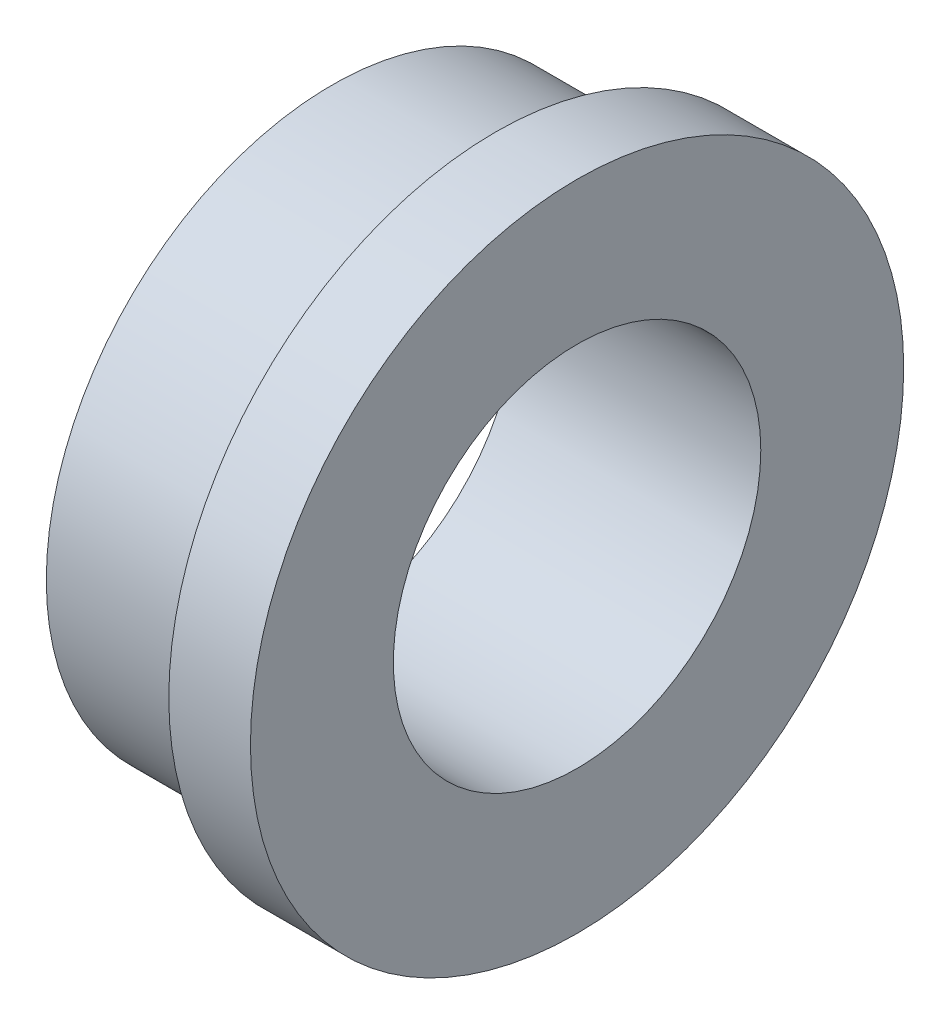
ISO-10303-21;
HEADER;
FILE_DESCRIPTION(('STEP AP214'),'2;1');
FILE_NAME('part.step','',(''),(''),'','','');
FILE_SCHEMA(('AUTOMOTIVE_DESIGN { 1 0 10303 214 1 1 1 1 }'));
ENDSEC;
DATA;
#1=APPLICATION_CONTEXT('core data for automotive mechanical design processes');
#2=APPLICATION_PROTOCOL_DEFINITION('international standard','automotive_design',2000,#1);
#3=PRODUCT_CONTEXT('',#1,'mechanical');
#4=PRODUCT('Part','Part','',(#3));
#5=PRODUCT_RELATED_PRODUCT_CATEGORY('part','',(#4));
#6=PRODUCT_DEFINITION_FORMATION('','',#4);
#7=PRODUCT_DEFINITION_CONTEXT('part definition',#1,'design');
#8=PRODUCT_DEFINITION('design','',#6,#7);
#9=PRODUCT_DEFINITION_SHAPE('','',#8);
#10=(LENGTH_UNIT() NAMED_UNIT(*) SI_UNIT(.MILLI.,.METRE.));
#11=(NAMED_UNIT(*) PLANE_ANGLE_UNIT() SI_UNIT($,.RADIAN.));
#12=(NAMED_UNIT(*) SI_UNIT($,.STERADIAN.) SOLID_ANGLE_UNIT());
#13=UNCERTAINTY_MEASURE_WITH_UNIT(LENGTH_MEASURE(1.E-05),#10,'distance_accuracy_value','');
#14=(GEOMETRIC_REPRESENTATION_CONTEXT(3) GLOBAL_UNCERTAINTY_ASSIGNED_CONTEXT((#13)) GLOBAL_UNIT_ASSIGNED_CONTEXT((#10,
#11,#12)) REPRESENTATION_CONTEXT('',''));
#15=CARTESIAN_POINT('',(0.,0.,0.));
#16=DIRECTION('',(0.,0.,1.));
#17=DIRECTION('',(1.,0.,0.));
#18=AXIS2_PLACEMENT_3D('',#15,#16,#17);
#19=CARTESIAN_POINT('',(0.,14.2875,0.));
#20=DIRECTION('',(1.,0.,0.));
#21=DIRECTION('',(0.,0.,-1.));
#22=AXIS2_PLACEMENT_3D('',#19,#20,#21);
#23=PLANE('',#22);
#24=CARTESIAN_POINT('',(0.,0.,0.));
#25=DIRECTION('',(1.,0.,0.));
#26=DIRECTION('',(0.,0.,-1.));
#27=AXIS2_PLACEMENT_3D('',#24,#25,#26);
#28=CIRCLE('',#27,25.4);
#29=CARTESIAN_POINT('',(0.,0.,-25.4));
#30=VERTEX_POINT('',#29);
#31=EDGE_CURVE('E10',#30,#30,#28,.T.);
#32=ORIENTED_EDGE('',*,*,#31,.T.);
#33=EDGE_LOOP('',(#32));
#34=FACE_BOUND('',#33,.T.);
#35=CARTESIAN_POINT('',(0.,0.,0.));
#36=DIRECTION('',(1.,0.,0.));
#37=DIRECTION('',(0.,0.,-1.));
#38=AXIS2_PLACEMENT_3D('',#35,#36,#37);
#39=CIRCLE('',#38,14.2875);
#40=CARTESIAN_POINT('',(0.,0.,-14.2875));
#41=VERTEX_POINT('',#40);
#42=EDGE_CURVE('E57',#41,#41,#39,.T.);
#43=ORIENTED_EDGE('',*,*,#42,.F.);
#44=EDGE_LOOP('',(#43));
#45=FACE_BOUND('',#44,.T.);
#46=ADVANCED_FACE('F35',(#34,#45),#23,.T.);
#47=CARTESIAN_POINT('',(0.,0.,0.));
#48=DIRECTION('',(1.,0.,0.));
#49=DIRECTION('',(0.,0.,-1.));
#50=AXIS2_PLACEMENT_3D('',#47,#48,#49);
#51=CYLINDRICAL_SURFACE('',#50,25.4);
#52=CARTESIAN_POINT('',(-6.35,0.,0.));
#53=DIRECTION('',(1.,0.,0.));
#54=DIRECTION('',(0.,0.,-1.));
#55=AXIS2_PLACEMENT_3D('',#52,#53,#54);
#56=CIRCLE('',#55,25.4);
#57=CARTESIAN_POINT('',(-6.35,0.,-25.4));
#58=VERTEX_POINT('',#57);
#59=EDGE_CURVE('E41',#58,#58,#56,.T.);
#60=ORIENTED_EDGE('',*,*,#59,.T.);
#61=EDGE_LOOP('',(#60));
#62=FACE_BOUND('',#61,.T.);
#63=ORIENTED_EDGE('',*,*,#31,.F.);
#64=EDGE_LOOP('',(#63));
#65=FACE_BOUND('',#64,.T.);
#66=ADVANCED_FACE('F65',(#62,#65),#51,.T.);
#67=CARTESIAN_POINT('',(-6.35,25.4,0.));
#68=DIRECTION('',(-1.,0.,0.));
#69=DIRECTION('',(0.,0.,1.));
#70=AXIS2_PLACEMENT_3D('',#67,#68,#69);
#71=PLANE('',#70);
#72=CARTESIAN_POINT('',(-6.35,0.,0.));
#73=DIRECTION('',(1.,0.,0.));
#74=DIRECTION('',(0.,0.,-1.));
#75=AXIS2_PLACEMENT_3D('',#72,#73,#74);
#76=CIRCLE('',#75,22.225);
#77=CARTESIAN_POINT('',(-6.35,0.,-22.225));
#78=VERTEX_POINT('',#77);
#79=EDGE_CURVE('E45',#78,#78,#76,.T.);
#80=ORIENTED_EDGE('',*,*,#79,.T.);
#81=EDGE_LOOP('',(#80));
#82=FACE_BOUND('',#81,.T.);
#83=ORIENTED_EDGE('',*,*,#59,.F.);
#84=EDGE_LOOP('',(#83));
#85=FACE_BOUND('',#84,.T.);
#86=ADVANCED_FACE('F69',(#82,#85),#71,.T.);
#87=CARTESIAN_POINT('',(0.,0.,0.));
#88=DIRECTION('',(1.,0.,0.));
#89=DIRECTION('',(0.,0.,-1.));
#90=AXIS2_PLACEMENT_3D('',#87,#88,#89);
#91=CYLINDRICAL_SURFACE('',#90,22.225);
#92=CARTESIAN_POINT('',(-19.05,0.,0.));
#93=DIRECTION('',(1.,0.,0.));
#94=DIRECTION('',(0.,0.,-1.));
#95=AXIS2_PLACEMENT_3D('',#92,#93,#94);
#96=CIRCLE('',#95,22.225);
#97=CARTESIAN_POINT('',(-19.05,0.,-22.225));
#98=VERTEX_POINT('',#97);
#99=EDGE_CURVE('E49',#98,#98,#96,.T.);
#100=ORIENTED_EDGE('',*,*,#99,.T.);
#101=EDGE_LOOP('',(#100));
#102=FACE_BOUND('',#101,.T.);
#103=ORIENTED_EDGE('',*,*,#79,.F.);
#104=EDGE_LOOP('',(#103));
#105=FACE_BOUND('',#104,.T.);
#106=ADVANCED_FACE('F73',(#102,#105),#91,.T.);
#107=CARTESIAN_POINT('',(-19.05,22.225,0.));
#108=DIRECTION('',(-1.,0.,0.));
#109=DIRECTION('',(0.,0.,1.));
#110=AXIS2_PLACEMENT_3D('',#107,#108,#109);
#111=PLANE('',#110);
#112=CARTESIAN_POINT('',(-19.05,0.,0.));
#113=DIRECTION('',(1.,0.,0.));
#114=DIRECTION('',(0.,0.,-1.));
#115=AXIS2_PLACEMENT_3D('',#112,#113,#114);
#116=CIRCLE('',#115,14.2875);
#117=CARTESIAN_POINT('',(-19.05,0.,-14.2875));
#118=VERTEX_POINT('',#117);
#119=EDGE_CURVE('E54',#118,#118,#116,.T.);
#120=ORIENTED_EDGE('',*,*,#119,.T.);
#121=EDGE_LOOP('',(#120));
#122=FACE_BOUND('',#121,.T.);
#123=ORIENTED_EDGE('',*,*,#99,.F.);
#124=EDGE_LOOP('',(#123));
#125=FACE_BOUND('',#124,.T.);
#126=ADVANCED_FACE('F80',(#122,#125),#111,.T.);
#127=CARTESIAN_POINT('',(0.,0.,0.));
#128=DIRECTION('',(1.,0.,0.));
#129=DIRECTION('',(0.,0.,-1.));
#130=AXIS2_PLACEMENT_3D('',#127,#128,#129);
#131=CYLINDRICAL_SURFACE('',#130,14.2875);
#132=ORIENTED_EDGE('',*,*,#42,.T.);
#133=EDGE_LOOP('',(#132));
#134=FACE_BOUND('',#133,.T.);
#135=ORIENTED_EDGE('',*,*,#119,.F.);
#136=EDGE_LOOP('',(#135));
#137=FACE_BOUND('',#136,.T.);
#138=ADVANCED_FACE('F61',(#134,#137),#131,.F.);
#139=CLOSED_SHELL('',(#46,#66,#86,#106,#126,#138));
#140=MANIFOLD_SOLID_BREP('B2',#139);
#141=ADVANCED_BREP_SHAPE_REPRESENTATION('',(#18,#140),#14);
#142=SHAPE_DEFINITION_REPRESENTATION(#9,#141);
ENDSEC;
END-ISO-10303-21;
